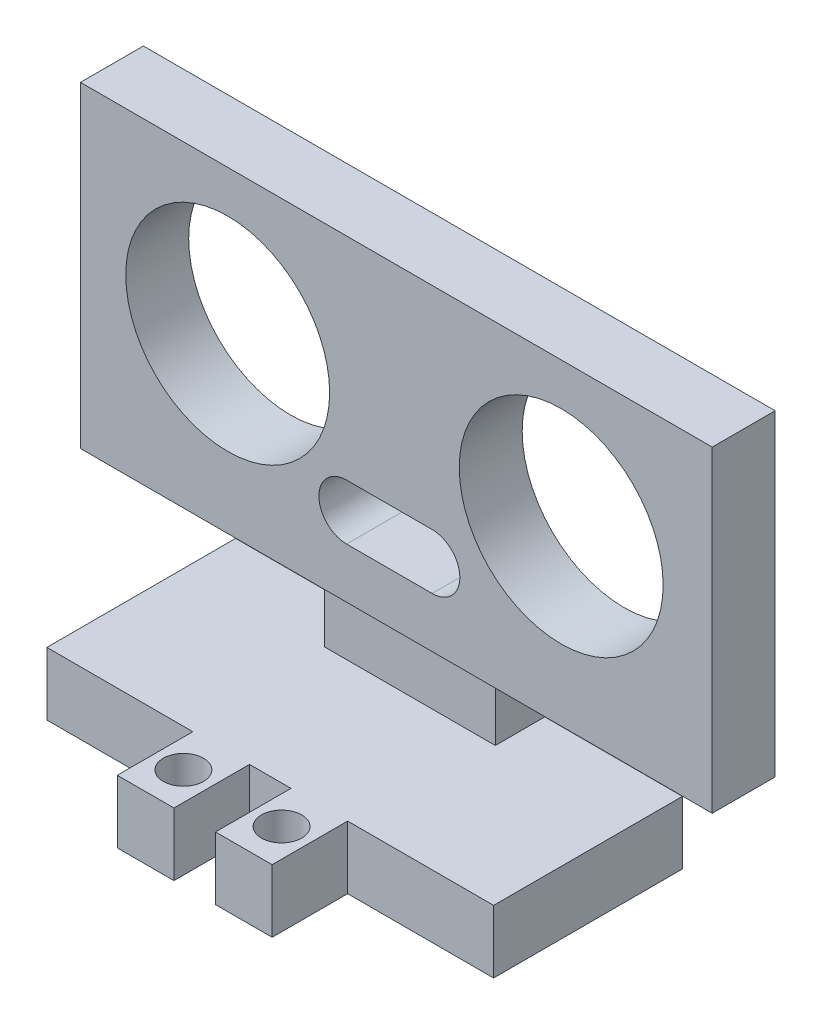
ISO-10303-21;
HEADER;
FILE_DESCRIPTION(('STEP AP214'),'2;1');
FILE_NAME('part.step','',(''),(''),'','','');
FILE_SCHEMA(('AUTOMOTIVE_DESIGN { 1 0 10303 214 1 1 1 1 }'));
ENDSEC;
DATA;
#1=APPLICATION_CONTEXT('core data for automotive mechanical design processes');
#2=APPLICATION_PROTOCOL_DEFINITION('international standard','automotive_design',2000,#1);
#3=PRODUCT_CONTEXT('',#1,'mechanical');
#4=PRODUCT('Part','Part','',(#3));
#5=PRODUCT_RELATED_PRODUCT_CATEGORY('part','',(#4));
#6=PRODUCT_DEFINITION_FORMATION('','',#4);
#7=PRODUCT_DEFINITION_CONTEXT('part definition',#1,'design');
#8=PRODUCT_DEFINITION('design','',#6,#7);
#9=PRODUCT_DEFINITION_SHAPE('','',#8);
#10=(LENGTH_UNIT() NAMED_UNIT(*) SI_UNIT(.MILLI.,.METRE.));
#11=(NAMED_UNIT(*) PLANE_ANGLE_UNIT() SI_UNIT($,.RADIAN.));
#12=(NAMED_UNIT(*) SI_UNIT($,.STERADIAN.) SOLID_ANGLE_UNIT());
#13=UNCERTAINTY_MEASURE_WITH_UNIT(LENGTH_MEASURE(1.E-05),#10,'distance_accuracy_value','');
#14=(GEOMETRIC_REPRESENTATION_CONTEXT(3) GLOBAL_UNCERTAINTY_ASSIGNED_CONTEXT((#13)) GLOBAL_UNIT_ASSIGNED_CONTEXT((#10,
#11,#12)) REPRESENTATION_CONTEXT('',''));
#15=CARTESIAN_POINT('',(0.,0.,0.));
#16=DIRECTION('',(0.,0.,1.));
#17=DIRECTION('',(1.,0.,0.));
#18=AXIS2_PLACEMENT_3D('',#15,#16,#17);
#19=CARTESIAN_POINT('',(0.,5.,-21.2753882568971));
#20=DIRECTION('',(0.,0.,-1.));
#21=DIRECTION('',(-1.,0.,0.));
#22=AXIS2_PLACEMENT_3D('',#19,#20,#21);
#23=PLANE('',#22);
#24=DIRECTION('',(1.,0.,0.));
#25=VECTOR('',#24,1.);
#26=CARTESIAN_POINT('',(0.,0.,-21.2753882568971));
#27=LINE('',#26,#25);
#28=CARTESIAN_POINT('',(12.7692142640546,0.,-21.2753882568971));
#29=VERTEX_POINT('',#28);
#30=CARTESIAN_POINT('',(48.2692142640546,0.,-21.2753882568971));
#31=VERTEX_POINT('',#30);
#32=EDGE_CURVE('E305',#29,#31,#27,.T.);
#33=ORIENTED_EDGE('',*,*,#32,.F.);
#34=DIRECTION('',(0.,-1.,0.));
#35=VECTOR('',#34,1.);
#36=CARTESIAN_POINT('',(12.7692142640546,5.,-21.2753882568971));
#37=LINE('',#36,#35);
#38=CARTESIAN_POINT('',(12.7692142640546,5.,-21.2753882568971));
#39=VERTEX_POINT('',#38);
#40=EDGE_CURVE('E392',#39,#29,#37,.T.);
#41=ORIENTED_EDGE('',*,*,#40,.F.);
#42=DIRECTION('',(1.,0.,0.));
#43=VECTOR('',#42,1.);
#44=CARTESIAN_POINT('',(0.,5.,-21.2753882568971));
#45=LINE('',#44,#43);
#46=CARTESIAN_POINT('',(23.7692142640546,5.,-21.2753882568971));
#47=VERTEX_POINT('',#46);
#48=EDGE_CURVE('E306',#39,#47,#45,.T.);
#49=ORIENTED_EDGE('',*,*,#48,.T.);
#50=DIRECTION('',(0.,-1.,0.));
#51=VECTOR('',#50,1.);
#52=CARTESIAN_POINT('',(23.7692142640546,10.,-21.2753882568971));
#53=LINE('',#52,#51);
#54=CARTESIAN_POINT('',(23.7692142640546,10.,-21.2753882568971));
#55=VERTEX_POINT('',#54);
#56=EDGE_CURVE('E286',#55,#47,#53,.T.);
#57=ORIENTED_EDGE('',*,*,#56,.F.);
#58=DIRECTION('',(-1.,0.,0.));
#59=VECTOR('',#58,1.);
#60=CARTESIAN_POINT('',(23.7692142640546,10.,-21.2753882568971));
#61=LINE('',#60,#59);
#62=CARTESIAN_POINT('',(37.3362993394962,10.,-21.2753882568971));
#63=VERTEX_POINT('',#62);
#64=EDGE_CURVE('E283',#63,#55,#61,.T.);
#65=ORIENTED_EDGE('',*,*,#64,.F.);
#66=DIRECTION('',(0.,-1.,0.));
#67=VECTOR('',#66,1.);
#68=CARTESIAN_POINT('',(37.3362993394962,10.,-21.2753882568971));
#69=LINE('',#68,#67);
#70=CARTESIAN_POINT('',(37.3362993394962,5.,-21.2753882568971));
#71=VERTEX_POINT('',#70);
#72=EDGE_CURVE('E296',#63,#71,#69,.T.);
#73=ORIENTED_EDGE('',*,*,#72,.T.);
#74=CARTESIAN_POINT('',(48.2692142640546,5.,-21.2753882568971));
#75=VERTEX_POINT('',#74);
#76=EDGE_CURVE('E310',#71,#75,#45,.T.);
#77=ORIENTED_EDGE('',*,*,#76,.T.);
#78=DIRECTION('',(0.,-1.,0.));
#79=VECTOR('',#78,1.);
#80=CARTESIAN_POINT('',(48.2692142640546,5.,-21.2753882568971));
#81=LINE('',#80,#79);
#82=EDGE_CURVE('E335',#75,#31,#81,.T.);
#83=ORIENTED_EDGE('',*,*,#82,.T.);
#84=EDGE_LOOP('',(#33,#41,#49,#57,#65,#73,#77,#83));
#85=FACE_BOUND('',#84,.T.);
#86=ADVANCED_FACE('F45',(#85),#23,.T.);
#87=CARTESIAN_POINT('',(12.7692142640546,5.,0.));
#88=DIRECTION('',(1.,0.,0.));
#89=DIRECTION('',(0.,0.,-1.));
#90=AXIS2_PLACEMENT_3D('',#87,#88,#89);
#91=PLANE('',#90);
#92=DIRECTION('',(0.,0.,1.));
#93=VECTOR('',#92,1.);
#94=CARTESIAN_POINT('',(12.7692142640546,0.,0.));
#95=LINE('',#94,#93);
#96=CARTESIAN_POINT('',(12.7692142640546,0.,-6.27538825689709));
#97=VERTEX_POINT('',#96);
#98=EDGE_CURVE('E338',#29,#97,#95,.T.);
#99=ORIENTED_EDGE('',*,*,#98,.T.);
#100=DIRECTION('',(0.,-1.,0.));
#101=VECTOR('',#100,1.);
#102=CARTESIAN_POINT('',(12.7692142640546,5.,-6.27538825689709));
#103=LINE('',#102,#101);
#104=CARTESIAN_POINT('',(12.7692142640546,5.,-6.27538825689709));
#105=VERTEX_POINT('',#104);
#106=EDGE_CURVE('E389',#105,#97,#103,.T.);
#107=ORIENTED_EDGE('',*,*,#106,.F.);
#108=DIRECTION('',(0.,0.,1.));
#109=VECTOR('',#108,1.);
#110=CARTESIAN_POINT('',(12.7692142640546,5.,0.));
#111=LINE('',#110,#109);
#112=EDGE_CURVE('E309',#39,#105,#111,.T.);
#113=ORIENTED_EDGE('',*,*,#112,.F.);
#114=ORIENTED_EDGE('',*,*,#40,.T.);
#115=EDGE_LOOP('',(#99,#107,#113,#114));
#116=FACE_BOUND('',#115,.T.);
#117=ADVANCED_FACE('F454',(#116),#91,.F.);
#118=CARTESIAN_POINT('',(0.,5.,-6.27538825689709));
#119=DIRECTION('',(0.,0.,-1.));
#120=DIRECTION('',(-1.,0.,0.));
#121=AXIS2_PLACEMENT_3D('',#118,#119,#120);
#122=PLANE('',#121);
#123=DIRECTION('',(1.,0.,0.));
#124=VECTOR('',#123,1.);
#125=CARTESIAN_POINT('',(0.,0.,-6.27538825689709));
#126=LINE('',#125,#124);
#127=CARTESIAN_POINT('',(24.3692142640547,0.,-6.27538825689709));
#128=VERTEX_POINT('',#127);
#129=EDGE_CURVE('E340',#97,#128,#126,.T.);
#130=ORIENTED_EDGE('',*,*,#129,.T.);
#131=DIRECTION('',(0.,-1.,0.));
#132=VECTOR('',#131,1.);
#133=CARTESIAN_POINT('',(24.3692142640547,5.,-6.27538825689709));
#134=LINE('',#133,#132);
#135=CARTESIAN_POINT('',(24.3692142640547,5.,-6.27538825689709));
#136=VERTEX_POINT('',#135);
#137=EDGE_CURVE('E387',#136,#128,#134,.T.);
#138=ORIENTED_EDGE('',*,*,#137,.F.);
#139=DIRECTION('',(1.,0.,0.));
#140=VECTOR('',#139,1.);
#141=CARTESIAN_POINT('',(0.,5.,-6.27538825689709));
#142=LINE('',#141,#140);
#143=EDGE_CURVE('E312',#105,#136,#142,.T.);
#144=ORIENTED_EDGE('',*,*,#143,.F.);
#145=ORIENTED_EDGE('',*,*,#106,.T.);
#146=EDGE_LOOP('',(#130,#138,#144,#145));
#147=FACE_BOUND('',#146,.T.);
#148=ADVANCED_FACE('F459',(#147),#122,.F.);
#149=CARTESIAN_POINT('',(24.3692142640547,5.,0.));
#150=DIRECTION('',(-1.,0.,0.));
#151=DIRECTION('',(0.,0.,1.));
#152=AXIS2_PLACEMENT_3D('',#149,#150,#151);
#153=PLANE('',#152);
#154=DIRECTION('',(0.,0.,-1.));
#155=VECTOR('',#154,1.);
#156=CARTESIAN_POINT('',(24.3692142640547,0.,0.));
#157=LINE('',#156,#155);
#158=CARTESIAN_POINT('',(24.3692142640547,0.,-0.275388256897094));
#159=VERTEX_POINT('',#158);
#160=EDGE_CURVE('E343',#159,#128,#157,.T.);
#161=ORIENTED_EDGE('',*,*,#160,.F.);
#162=DIRECTION('',(0.,-1.,0.));
#163=VECTOR('',#162,1.);
#164=CARTESIAN_POINT('',(24.3692142640547,5.,-0.275388256897094));
#165=LINE('',#164,#163);
#166=CARTESIAN_POINT('',(24.3692142640547,5.,-0.275388256897094));
#167=VERTEX_POINT('',#166);
#168=EDGE_CURVE('E385',#167,#159,#165,.T.);
#169=ORIENTED_EDGE('',*,*,#168,.F.);
#170=DIRECTION('',(0.,0.,-1.));
#171=VECTOR('',#170,1.);
#172=CARTESIAN_POINT('',(24.3692142640547,5.,0.));
#173=LINE('',#172,#171);
#174=EDGE_CURVE('E314',#167,#136,#173,.T.);
#175=ORIENTED_EDGE('',*,*,#174,.T.);
#176=ORIENTED_EDGE('',*,*,#137,.T.);
#177=EDGE_LOOP('',(#161,#169,#175,#176));
#178=FACE_BOUND('',#177,.T.);
#179=ADVANCED_FACE('F464',(#178),#153,.T.);
#180=CARTESIAN_POINT('',(0.,5.,-0.275388256897092));
#181=DIRECTION('',(0.,0.,-1.));
#182=DIRECTION('',(-1.,0.,0.));
#183=AXIS2_PLACEMENT_3D('',#180,#181,#182);
#184=PLANE('',#183);
#185=DIRECTION('',(1.,0.,0.));
#186=VECTOR('',#185,1.);
#187=CARTESIAN_POINT('',(0.,0.,-0.275388256897092));
#188=LINE('',#187,#186);
#189=CARTESIAN_POINT('',(28.8692142640547,0.,-0.275388256897094));
#190=VERTEX_POINT('',#189);
#191=EDGE_CURVE('E346',#159,#190,#188,.T.);
#192=ORIENTED_EDGE('',*,*,#191,.T.);
#193=DIRECTION('',(0.,-1.,0.));
#194=VECTOR('',#193,1.);
#195=CARTESIAN_POINT('',(28.8692142640547,5.,-0.275388256897094));
#196=LINE('',#195,#194);
#197=CARTESIAN_POINT('',(28.8692142640547,5.,-0.275388256897094));
#198=VERTEX_POINT('',#197);
#199=EDGE_CURVE('E382',#198,#190,#196,.T.);
#200=ORIENTED_EDGE('',*,*,#199,.F.);
#201=DIRECTION('',(1.,0.,0.));
#202=VECTOR('',#201,1.);
#203=CARTESIAN_POINT('',(0.,5.,-0.275388256897092));
#204=LINE('',#203,#202);
#205=EDGE_CURVE('E317',#167,#198,#204,.T.);
#206=ORIENTED_EDGE('',*,*,#205,.F.);
#207=ORIENTED_EDGE('',*,*,#168,.T.);
#208=EDGE_LOOP('',(#192,#200,#206,#207));
#209=FACE_BOUND('',#208,.T.);
#210=ADVANCED_FACE('F470',(#209),#184,.F.);
#211=CARTESIAN_POINT('',(28.8692142640547,5.,0.));
#212=DIRECTION('',(-1.,0.,0.));
#213=DIRECTION('',(0.,0.,1.));
#214=AXIS2_PLACEMENT_3D('',#211,#212,#213);
#215=PLANE('',#214);
#216=DIRECTION('',(0.,0.,-1.));
#217=VECTOR('',#216,1.);
#218=CARTESIAN_POINT('',(28.8692142640547,0.,0.));
#219=LINE('',#218,#217);
#220=CARTESIAN_POINT('',(28.8692142640547,0.,-6.27538825689709));
#221=VERTEX_POINT('',#220);
#222=EDGE_CURVE('E348',#190,#221,#219,.T.);
#223=ORIENTED_EDGE('',*,*,#222,.T.);
#224=DIRECTION('',(0.,-1.,0.));
#225=VECTOR('',#224,1.);
#226=CARTESIAN_POINT('',(28.8692142640547,5.,-6.27538825689709));
#227=LINE('',#226,#225);
#228=CARTESIAN_POINT('',(28.8692142640547,5.,-6.27538825689709));
#229=VERTEX_POINT('',#228);
#230=EDGE_CURVE('E379',#229,#221,#227,.T.);
#231=ORIENTED_EDGE('',*,*,#230,.F.);
#232=DIRECTION('',(0.,0.,-1.));
#233=VECTOR('',#232,1.);
#234=CARTESIAN_POINT('',(28.8692142640547,5.,0.));
#235=LINE('',#234,#233);
#236=EDGE_CURVE('E319',#198,#229,#235,.T.);
#237=ORIENTED_EDGE('',*,*,#236,.F.);
#238=ORIENTED_EDGE('',*,*,#199,.T.);
#239=EDGE_LOOP('',(#223,#231,#237,#238));
#240=FACE_BOUND('',#239,.T.);
#241=ADVANCED_FACE('F474',(#240),#215,.F.);
#242=CARTESIAN_POINT('',(0.,5.,-6.27538825689709));
#243=DIRECTION('',(0.,0.,-1.));
#244=DIRECTION('',(-1.,0.,0.));
#245=AXIS2_PLACEMENT_3D('',#242,#243,#244);
#246=PLANE('',#245);
#247=DIRECTION('',(1.,0.,0.));
#248=VECTOR('',#247,1.);
#249=CARTESIAN_POINT('',(0.,0.,-6.27538825689709));
#250=LINE('',#249,#248);
#251=CARTESIAN_POINT('',(32.1692142640546,0.,-6.27538825689709));
#252=VERTEX_POINT('',#251);
#253=EDGE_CURVE('E350',#221,#252,#250,.T.);
#254=ORIENTED_EDGE('',*,*,#253,.T.);
#255=DIRECTION('',(0.,-1.,0.));
#256=VECTOR('',#255,1.);
#257=CARTESIAN_POINT('',(32.1692142640546,5.,-6.27538825689709));
#258=LINE('',#257,#256);
#259=CARTESIAN_POINT('',(32.1692142640546,5.,-6.27538825689709));
#260=VERTEX_POINT('',#259);
#261=EDGE_CURVE('E377',#260,#252,#258,.T.);
#262=ORIENTED_EDGE('',*,*,#261,.F.);
#263=DIRECTION('',(1.,0.,0.));
#264=VECTOR('',#263,1.);
#265=CARTESIAN_POINT('',(0.,5.,-6.27538825689709));
#266=LINE('',#265,#264);
#267=EDGE_CURVE('E321',#229,#260,#266,.T.);
#268=ORIENTED_EDGE('',*,*,#267,.F.);
#269=ORIENTED_EDGE('',*,*,#230,.T.);
#270=EDGE_LOOP('',(#254,#262,#268,#269));
#271=FACE_BOUND('',#270,.T.);
#272=ADVANCED_FACE('F478',(#271),#246,.F.);
#273=CARTESIAN_POINT('',(32.1692142640546,5.,0.));
#274=DIRECTION('',(-1.,0.,0.));
#275=DIRECTION('',(0.,0.,1.));
#276=AXIS2_PLACEMENT_3D('',#273,#274,#275);
#277=PLANE('',#276);
#278=DIRECTION('',(0.,0.,-1.));
#279=VECTOR('',#278,1.);
#280=CARTESIAN_POINT('',(32.1692142640546,0.,0.));
#281=LINE('',#280,#279);
#282=CARTESIAN_POINT('',(32.1692142640546,0.,-0.275388256897094));
#283=VERTEX_POINT('',#282);
#284=EDGE_CURVE('E353',#283,#252,#281,.T.);
#285=ORIENTED_EDGE('',*,*,#284,.F.);
#286=DIRECTION('',(0.,-1.,0.));
#287=VECTOR('',#286,1.);
#288=CARTESIAN_POINT('',(32.1692142640546,5.,-0.275388256897094));
#289=LINE('',#288,#287);
#290=CARTESIAN_POINT('',(32.1692142640546,5.,-0.275388256897094));
#291=VERTEX_POINT('',#290);
#292=EDGE_CURVE('E375',#291,#283,#289,.T.);
#293=ORIENTED_EDGE('',*,*,#292,.F.);
#294=DIRECTION('',(0.,0.,-1.));
#295=VECTOR('',#294,1.);
#296=CARTESIAN_POINT('',(32.1692142640546,5.,0.));
#297=LINE('',#296,#295);
#298=EDGE_CURVE('E323',#291,#260,#297,.T.);
#299=ORIENTED_EDGE('',*,*,#298,.T.);
#300=ORIENTED_EDGE('',*,*,#261,.T.);
#301=EDGE_LOOP('',(#285,#293,#299,#300));
#302=FACE_BOUND('',#301,.T.);
#303=ADVANCED_FACE('F482',(#302),#277,.T.);
#304=CARTESIAN_POINT('',(0.,5.,-0.275388256897095));
#305=DIRECTION('',(0.,0.,-1.));
#306=DIRECTION('',(-1.,0.,0.));
#307=AXIS2_PLACEMENT_3D('',#304,#305,#306);
#308=PLANE('',#307);
#309=DIRECTION('',(1.,0.,0.));
#310=VECTOR('',#309,1.);
#311=CARTESIAN_POINT('',(0.,0.,-0.275388256897095));
#312=LINE('',#311,#310);
#313=CARTESIAN_POINT('',(36.6692142640546,0.,-0.275388256897094));
#314=VERTEX_POINT('',#313);
#315=EDGE_CURVE('E356',#283,#314,#312,.T.);
#316=ORIENTED_EDGE('',*,*,#315,.T.);
#317=DIRECTION('',(0.,-1.,0.));
#318=VECTOR('',#317,1.);
#319=CARTESIAN_POINT('',(36.6692142640546,5.,-0.275388256897094));
#320=LINE('',#319,#318);
#321=CARTESIAN_POINT('',(36.6692142640546,5.,-0.275388256897094));
#322=VERTEX_POINT('',#321);
#323=EDGE_CURVE('E372',#322,#314,#320,.T.);
#324=ORIENTED_EDGE('',*,*,#323,.F.);
#325=DIRECTION('',(1.,0.,0.));
#326=VECTOR('',#325,1.);
#327=CARTESIAN_POINT('',(0.,5.,-0.275388256897095));
#328=LINE('',#327,#326);
#329=EDGE_CURVE('E326',#291,#322,#328,.T.);
#330=ORIENTED_EDGE('',*,*,#329,.F.);
#331=ORIENTED_EDGE('',*,*,#292,.T.);
#332=EDGE_LOOP('',(#316,#324,#330,#331));
#333=FACE_BOUND('',#332,.T.);
#334=ADVANCED_FACE('F486',(#333),#308,.F.);
#335=CARTESIAN_POINT('',(36.6692142640546,5.,0.));
#336=DIRECTION('',(-1.,0.,0.));
#337=DIRECTION('',(0.,0.,1.));
#338=AXIS2_PLACEMENT_3D('',#335,#336,#337);
#339=PLANE('',#338);
#340=DIRECTION('',(0.,0.,-1.));
#341=VECTOR('',#340,1.);
#342=CARTESIAN_POINT('',(36.6692142640546,0.,0.));
#343=LINE('',#342,#341);
#344=CARTESIAN_POINT('',(36.6692142640546,0.,-6.27538825689709));
#345=VERTEX_POINT('',#344);
#346=EDGE_CURVE('E358',#314,#345,#343,.T.);
#347=ORIENTED_EDGE('',*,*,#346,.T.);
#348=DIRECTION('',(0.,-1.,0.));
#349=VECTOR('',#348,1.);
#350=CARTESIAN_POINT('',(36.6692142640546,5.,-6.27538825689709));
#351=LINE('',#350,#349);
#352=CARTESIAN_POINT('',(36.6692142640546,5.,-6.27538825689709));
#353=VERTEX_POINT('',#352);
#354=EDGE_CURVE('E369',#353,#345,#351,.T.);
#355=ORIENTED_EDGE('',*,*,#354,.F.);
#356=DIRECTION('',(0.,0.,-1.));
#357=VECTOR('',#356,1.);
#358=CARTESIAN_POINT('',(36.6692142640546,5.,0.));
#359=LINE('',#358,#357);
#360=EDGE_CURVE('E328',#322,#353,#359,.T.);
#361=ORIENTED_EDGE('',*,*,#360,.F.);
#362=ORIENTED_EDGE('',*,*,#323,.T.);
#363=EDGE_LOOP('',(#347,#355,#361,#362));
#364=FACE_BOUND('',#363,.T.);
#365=ADVANCED_FACE('F490',(#364),#339,.F.);
#366=CARTESIAN_POINT('',(0.,5.,-6.27538825689709));
#367=DIRECTION('',(0.,0.,-1.));
#368=DIRECTION('',(-1.,0.,0.));
#369=AXIS2_PLACEMENT_3D('',#366,#367,#368);
#370=PLANE('',#369);
#371=DIRECTION('',(1.,0.,0.));
#372=VECTOR('',#371,1.);
#373=CARTESIAN_POINT('',(0.,0.,-6.27538825689709));
#374=LINE('',#373,#372);
#375=CARTESIAN_POINT('',(48.2692142640546,0.,-6.27538825689709));
#376=VERTEX_POINT('',#375);
#377=EDGE_CURVE('E360',#345,#376,#374,.T.);
#378=ORIENTED_EDGE('',*,*,#377,.T.);
#379=DIRECTION('',(0.,-1.,0.));
#380=VECTOR('',#379,1.);
#381=CARTESIAN_POINT('',(48.2692142640546,5.,-6.27538825689709));
#382=LINE('',#381,#380);
#383=CARTESIAN_POINT('',(48.2692142640546,5.,-6.27538825689709));
#384=VERTEX_POINT('',#383);
#385=EDGE_CURVE('E367',#384,#376,#382,.T.);
#386=ORIENTED_EDGE('',*,*,#385,.F.);
#387=DIRECTION('',(1.,0.,0.));
#388=VECTOR('',#387,1.);
#389=CARTESIAN_POINT('',(0.,5.,-6.27538825689709));
#390=LINE('',#389,#388);
#391=EDGE_CURVE('E330',#353,#384,#390,.T.);
#392=ORIENTED_EDGE('',*,*,#391,.F.);
#393=ORIENTED_EDGE('',*,*,#354,.T.);
#394=EDGE_LOOP('',(#378,#386,#392,#393));
#395=FACE_BOUND('',#394,.T.);
#396=ADVANCED_FACE('F494',(#395),#370,.F.);
#397=CARTESIAN_POINT('',(48.2692142640546,5.,0.));
#398=DIRECTION('',(1.,0.,0.));
#399=DIRECTION('',(0.,0.,-1.));
#400=AXIS2_PLACEMENT_3D('',#397,#398,#399);
#401=PLANE('',#400);
#402=DIRECTION('',(0.,0.,1.));
#403=VECTOR('',#402,1.);
#404=CARTESIAN_POINT('',(48.2692142640546,0.,0.));
#405=LINE('',#404,#403);
#406=EDGE_CURVE('E363',#31,#376,#405,.T.);
#407=ORIENTED_EDGE('',*,*,#406,.F.);
#408=ORIENTED_EDGE('',*,*,#82,.F.);
#409=DIRECTION('',(0.,0.,1.));
#410=VECTOR('',#409,1.);
#411=CARTESIAN_POINT('',(48.2692142640546,5.,0.));
#412=LINE('',#411,#410);
#413=EDGE_CURVE('E332',#75,#384,#412,.T.);
#414=ORIENTED_EDGE('',*,*,#413,.T.);
#415=ORIENTED_EDGE('',*,*,#385,.T.);
#416=EDGE_LOOP('',(#407,#408,#414,#415));
#417=FACE_BOUND('',#416,.T.);
#418=ADVANCED_FACE('F423',(#417),#401,.T.);
#419=CARTESIAN_POINT('',(0.,5.,0.));
#420=DIRECTION('',(0.,1.,0.));
#421=DIRECTION('',(0.,0.,1.));
#422=AXIS2_PLACEMENT_3D('',#419,#420,#421);
#423=PLANE('',#422);
#424=CARTESIAN_POINT('',(26.6192142640546,5.,-3.27538825689709));
#425=DIRECTION('',(0.,1.,0.));
#426=DIRECTION('',(0.,0.,1.));
#427=AXIS2_PLACEMENT_3D('',#424,#425,#426);
#428=CIRCLE('',#427,1.6);
#429=CARTESIAN_POINT('',(26.6192142640546,5.,-1.67538825689709));
#430=VERTEX_POINT('',#429);
#431=EDGE_CURVE('E403',#430,#430,#428,.T.);
#432=ORIENTED_EDGE('',*,*,#431,.F.);
#433=EDGE_LOOP('',(#432));
#434=FACE_BOUND('',#433,.T.);
#435=CARTESIAN_POINT('',(34.4192142640546,5.,-3.27538825689709));
#436=DIRECTION('',(0.,1.,0.));
#437=DIRECTION('',(0.,0.,1.));
#438=AXIS2_PLACEMENT_3D('',#435,#436,#437);
#439=CIRCLE('',#438,1.6);
#440=CARTESIAN_POINT('',(34.4192142640546,5.,-1.6753882568971));
#441=VERTEX_POINT('',#440);
#442=EDGE_CURVE('E408',#441,#441,#439,.T.);
#443=ORIENTED_EDGE('',*,*,#442,.F.);
#444=EDGE_LOOP('',(#443));
#445=FACE_BOUND('',#444,.T.);
#446=DIRECTION('',(0.,0.,1.));
#447=VECTOR('',#446,1.);
#448=CARTESIAN_POINT('',(23.7692142640546,5.,-21.2753882568971));
#449=LINE('',#448,#447);
#450=CARTESIAN_POINT('',(23.7692142640546,5.,-17.3425959706985));
#451=VERTEX_POINT('',#450);
#452=EDGE_CURVE('E272',#47,#451,#449,.T.);
#453=ORIENTED_EDGE('',*,*,#452,.F.);
#454=ORIENTED_EDGE('',*,*,#48,.F.);
#455=ORIENTED_EDGE('',*,*,#112,.T.);
#456=ORIENTED_EDGE('',*,*,#143,.T.);
#457=ORIENTED_EDGE('',*,*,#174,.F.);
#458=ORIENTED_EDGE('',*,*,#205,.T.);
#459=ORIENTED_EDGE('',*,*,#236,.T.);
#460=ORIENTED_EDGE('',*,*,#267,.T.);
#461=ORIENTED_EDGE('',*,*,#298,.F.);
#462=ORIENTED_EDGE('',*,*,#329,.T.);
#463=ORIENTED_EDGE('',*,*,#360,.T.);
#464=ORIENTED_EDGE('',*,*,#391,.T.);
#465=ORIENTED_EDGE('',*,*,#413,.F.);
#466=ORIENTED_EDGE('',*,*,#76,.F.);
#467=DIRECTION('',(0.,0.,-1.));
#468=VECTOR('',#467,1.);
#469=CARTESIAN_POINT('',(37.3362993394962,5.,-21.2753882568971));
#470=LINE('',#469,#468);
#471=CARTESIAN_POINT('',(37.3362993394962,5.,-17.3425959706985));
#472=VERTEX_POINT('',#471);
#473=EDGE_CURVE('E277',#472,#71,#470,.T.);
#474=ORIENTED_EDGE('',*,*,#473,.F.);
#475=DIRECTION('',(1.,0.,0.));
#476=VECTOR('',#475,1.);
#477=CARTESIAN_POINT('',(23.7692142640546,5.,-17.3425959706985));
#478=LINE('',#477,#476);
#479=EDGE_CURVE('E289',#451,#472,#478,.T.);
#480=ORIENTED_EDGE('',*,*,#479,.F.);
#481=EDGE_LOOP('',(#453,#454,#455,#456,#457,#458,#459,#460,#461,#462,#463,#464,#465,#466,#474,#480));
#482=FACE_BOUND('',#481,.T.);
#483=ADVANCED_FACE('F419',(#434,#445,#482),#423,.T.);
#484=CARTESIAN_POINT('',(0.,0.,0.));
#485=DIRECTION('',(0.,1.,0.));
#486=DIRECTION('',(0.,0.,1.));
#487=AXIS2_PLACEMENT_3D('',#484,#485,#486);
#488=PLANE('',#487);
#489=CARTESIAN_POINT('',(26.6192142640546,0.,-3.27538825689709));
#490=DIRECTION('',(0.,1.,0.));
#491=DIRECTION('',(0.,0.,1.));
#492=AXIS2_PLACEMENT_3D('',#489,#490,#491);
#493=CIRCLE('',#492,1.6);
#494=CARTESIAN_POINT('',(26.6192142640546,0.,-1.67538825689709));
#495=VERTEX_POINT('',#494);
#496=EDGE_CURVE('E48',#495,#495,#493,.T.);
#497=ORIENTED_EDGE('',*,*,#496,.T.);
#498=EDGE_LOOP('',(#497));
#499=FACE_BOUND('',#498,.T.);
#500=CARTESIAN_POINT('',(34.4192142640546,0.,-3.27538825689709));
#501=DIRECTION('',(0.,1.,0.));
#502=DIRECTION('',(0.,0.,1.));
#503=AXIS2_PLACEMENT_3D('',#500,#501,#502);
#504=CIRCLE('',#503,1.6);
#505=CARTESIAN_POINT('',(34.4192142640546,0.,-1.6753882568971));
#506=VERTEX_POINT('',#505);
#507=EDGE_CURVE('E401',#506,#506,#504,.T.);
#508=ORIENTED_EDGE('',*,*,#507,.T.);
#509=EDGE_LOOP('',(#508));
#510=FACE_BOUND('',#509,.T.);
#511=ORIENTED_EDGE('',*,*,#32,.T.);
#512=ORIENTED_EDGE('',*,*,#406,.T.);
#513=ORIENTED_EDGE('',*,*,#377,.F.);
#514=ORIENTED_EDGE('',*,*,#346,.F.);
#515=ORIENTED_EDGE('',*,*,#315,.F.);
#516=ORIENTED_EDGE('',*,*,#284,.T.);
#517=ORIENTED_EDGE('',*,*,#253,.F.);
#518=ORIENTED_EDGE('',*,*,#222,.F.);
#519=ORIENTED_EDGE('',*,*,#191,.F.);
#520=ORIENTED_EDGE('',*,*,#160,.T.);
#521=ORIENTED_EDGE('',*,*,#129,.F.);
#522=ORIENTED_EDGE('',*,*,#98,.F.);
#523=EDGE_LOOP('',(#511,#512,#513,#514,#515,#516,#517,#518,#519,#520,#521,#522));
#524=FACE_BOUND('',#523,.T.);
#525=ADVANCED_FACE('F422',(#499,#510,#524),#488,.F.);
#526=CARTESIAN_POINT('',(23.7692142640546,10.,-21.2753882568971));
#527=DIRECTION('',(1.,0.,0.));
#528=DIRECTION('',(0.,0.,-1.));
#529=AXIS2_PLACEMENT_3D('',#526,#527,#528);
#530=PLANE('',#529);
#531=ORIENTED_EDGE('',*,*,#452,.T.);
#532=DIRECTION('',(0.,-1.,0.));
#533=VECTOR('',#532,1.);
#534=CARTESIAN_POINT('',(23.7692142640546,10.,-17.3425959706985));
#535=LINE('',#534,#533);
#536=CARTESIAN_POINT('',(23.7692142640546,10.,-17.3425959706985));
#537=VERTEX_POINT('',#536);
#538=EDGE_CURVE('E302',#537,#451,#535,.T.);
#539=ORIENTED_EDGE('',*,*,#538,.F.);
#540=DIRECTION('',(0.,0.,1.));
#541=VECTOR('',#540,1.);
#542=CARTESIAN_POINT('',(23.7692142640546,10.,-21.2753882568971));
#543=LINE('',#542,#541);
#544=EDGE_CURVE('E273',#55,#537,#543,.T.);
#545=ORIENTED_EDGE('',*,*,#544,.F.);
#546=ORIENTED_EDGE('',*,*,#56,.T.);
#547=EDGE_LOOP('',(#531,#539,#545,#546));
#548=FACE_BOUND('',#547,.T.);
#549=ADVANCED_FACE('F434',(#548),#530,.F.);
#550=CARTESIAN_POINT('',(23.7692142640546,10.,-17.3425959706985));
#551=DIRECTION('',(0.,0.,-1.));
#552=DIRECTION('',(-1.,0.,0.));
#553=AXIS2_PLACEMENT_3D('',#550,#551,#552);
#554=PLANE('',#553);
#555=ORIENTED_EDGE('',*,*,#479,.T.);
#556=DIRECTION('',(0.,-1.,0.));
#557=VECTOR('',#556,1.);
#558=CARTESIAN_POINT('',(37.3362993394962,10.,-17.3425959706985));
#559=LINE('',#558,#557);
#560=CARTESIAN_POINT('',(37.3362993394962,10.,-17.3425959706985));
#561=VERTEX_POINT('',#560);
#562=EDGE_CURVE('E299',#561,#472,#559,.T.);
#563=ORIENTED_EDGE('',*,*,#562,.F.);
#564=DIRECTION('',(1.,0.,0.));
#565=VECTOR('',#564,1.);
#566=CARTESIAN_POINT('',(23.7692142640546,10.,-17.3425959706985));
#567=LINE('',#566,#565);
#568=EDGE_CURVE('E276',#537,#561,#567,.T.);
#569=ORIENTED_EDGE('',*,*,#568,.F.);
#570=ORIENTED_EDGE('',*,*,#538,.T.);
#571=EDGE_LOOP('',(#555,#563,#569,#570));
#572=FACE_BOUND('',#571,.T.);
#573=ADVANCED_FACE('F444',(#572),#554,.F.);
#574=CARTESIAN_POINT('',(37.3362993394962,10.,-21.2753882568971));
#575=DIRECTION('',(-1.,0.,0.));
#576=DIRECTION('',(0.,0.,1.));
#577=AXIS2_PLACEMENT_3D('',#574,#575,#576);
#578=PLANE('',#577);
#579=ORIENTED_EDGE('',*,*,#473,.T.);
#580=ORIENTED_EDGE('',*,*,#72,.F.);
#581=DIRECTION('',(0.,0.,-1.));
#582=VECTOR('',#581,1.);
#583=CARTESIAN_POINT('',(37.3362993394962,10.,-21.2753882568971));
#584=LINE('',#583,#582);
#585=EDGE_CURVE('E280',#561,#63,#584,.T.);
#586=ORIENTED_EDGE('',*,*,#585,.F.);
#587=ORIENTED_EDGE('',*,*,#562,.T.);
#588=EDGE_LOOP('',(#579,#580,#586,#587));
#589=FACE_BOUND('',#588,.T.);
#590=ADVANCED_FACE('F441',(#589),#578,.F.);
#591=CARTESIAN_POINT('',(5.41921426405465,35.2,-16.2947715854473));
#592=DIRECTION('',(0.,0.,-1.));
#593=DIRECTION('',(-1.,0.,0.));
#594=AXIS2_PLACEMENT_3D('',#591,#592,#593);
#595=PLANE('',#594);
#596=CARTESIAN_POINT('',(33.3664211853097,16.2,-16.2947715854473));
#597=DIRECTION('',(0.,0.,1.));
#598=DIRECTION('',(1.,0.,0.));
#599=AXIS2_PLACEMENT_3D('',#596,#597,#598);
#600=CIRCLE('',#599,2.2);
#601=CARTESIAN_POINT('',(33.3664211853097,14.,-16.2947715854473));
#602=VERTEX_POINT('',#601);
#603=CARTESIAN_POINT('',(33.3664211853097,18.4,-16.2947715854473));
#604=VERTEX_POINT('',#603);
#605=EDGE_CURVE('E218',#602,#604,#600,.T.);
#606=ORIENTED_EDGE('',*,*,#605,.F.);
#607=DIRECTION('',(1.,0.,0.));
#608=VECTOR('',#607,1.);
#609=CARTESIAN_POINT('',(0.,14.,-16.2947715854473));
#610=LINE('',#609,#608);
#611=CARTESIAN_POINT('',(26.5664211853097,14.,-16.2947715854473));
#612=VERTEX_POINT('',#611);
#613=EDGE_CURVE('E61',#612,#602,#610,.T.);
#614=ORIENTED_EDGE('',*,*,#613,.F.);
#615=CARTESIAN_POINT('',(26.5664211853097,16.2,-16.2947715854473));
#616=DIRECTION('',(0.,0.,1.));
#617=DIRECTION('',(1.,0.,0.));
#618=AXIS2_PLACEMENT_3D('',#615,#616,#617);
#619=CIRCLE('',#618,2.2);
#620=CARTESIAN_POINT('',(26.5664211853097,18.4,-16.2947715854473));
#621=VERTEX_POINT('',#620);
#622=EDGE_CURVE('E225',#621,#612,#619,.T.);
#623=ORIENTED_EDGE('',*,*,#622,.F.);
#624=DIRECTION('',(1.,0.,0.));
#625=VECTOR('',#624,1.);
#626=CARTESIAN_POINT('',(0.,18.4,-16.2947715854473));
#627=LINE('',#626,#625);
#628=EDGE_CURVE('E209',#621,#604,#627,.T.);
#629=ORIENTED_EDGE('',*,*,#628,.T.);
#630=EDGE_LOOP('',(#606,#614,#623,#629));
#631=FACE_BOUND('',#630,.T.);
#632=CARTESIAN_POINT('',(17.1192142640547,23.75,-16.2947715854473));
#633=DIRECTION('',(0.,0.,1.));
#634=DIRECTION('',(1.,0.,0.));
#635=AXIS2_PLACEMENT_3D('',#632,#633,#634);
#636=CIRCLE('',#635,8.09999999999999);
#637=CARTESIAN_POINT('',(25.2192142640546,23.75,-16.2947715854473));
#638=VERTEX_POINT('',#637);
#639=EDGE_CURVE('E235',#638,#638,#636,.T.);
#640=ORIENTED_EDGE('',*,*,#639,.F.);
#641=EDGE_LOOP('',(#640));
#642=FACE_BOUND('',#641,.T.);
#643=CARTESIAN_POINT('',(43.6192142640547,23.75,-16.2947715854473));
#644=DIRECTION('',(0.,0.,1.));
#645=DIRECTION('',(1.,0.,0.));
#646=AXIS2_PLACEMENT_3D('',#643,#644,#645);
#647=CIRCLE('',#646,8.1);
#648=CARTESIAN_POINT('',(51.7192142640546,23.75,-16.2947715854473));
#649=VERTEX_POINT('',#648);
#650=EDGE_CURVE('E232',#649,#649,#647,.T.);
#651=ORIENTED_EDGE('',*,*,#650,.F.);
#652=EDGE_LOOP('',(#651));
#653=FACE_BOUND('',#652,.T.);
#654=DIRECTION('',(1.,0.,0.));
#655=VECTOR('',#654,1.);
#656=CARTESIAN_POINT('',(5.41921426405465,10.,-16.2947715854473));
#657=LINE('',#656,#655);
#658=CARTESIAN_POINT('',(5.41921426405465,10.,-16.2947715854473));
#659=VERTEX_POINT('',#658);
#660=CARTESIAN_POINT('',(55.6192142640547,10.,-16.2947715854473));
#661=VERTEX_POINT('',#660);
#662=EDGE_CURVE('E253',#659,#661,#657,.T.);
#663=ORIENTED_EDGE('',*,*,#662,.T.);
#664=DIRECTION('',(0.,-1.,0.));
#665=VECTOR('',#664,1.);
#666=CARTESIAN_POINT('',(55.6192142640547,35.2,-16.2947715854473));
#667=LINE('',#666,#665);
#668=CARTESIAN_POINT('',(55.6192142640547,35.2,-16.2947715854473));
#669=VERTEX_POINT('',#668);
#670=EDGE_CURVE('E270',#669,#661,#667,.T.);
#671=ORIENTED_EDGE('',*,*,#670,.F.);
#672=DIRECTION('',(1.,0.,0.));
#673=VECTOR('',#672,1.);
#674=CARTESIAN_POINT('',(5.41921426405465,35.2,-16.2947715854473));
#675=LINE('',#674,#673);
#676=CARTESIAN_POINT('',(5.41921426405465,35.2,-16.2947715854473));
#677=VERTEX_POINT('',#676);
#678=EDGE_CURVE('E241',#677,#669,#675,.T.);
#679=ORIENTED_EDGE('',*,*,#678,.F.);
#680=DIRECTION('',(0.,-1.,0.));
#681=VECTOR('',#680,1.);
#682=CARTESIAN_POINT('',(5.41921426405465,35.2,-16.2947715854473));
#683=LINE('',#682,#681);
#684=EDGE_CURVE('E252',#677,#659,#683,.T.);
#685=ORIENTED_EDGE('',*,*,#684,.T.);
#686=EDGE_LOOP('',(#663,#671,#679,#685));
#687=FACE_BOUND('',#686,.T.);
#688=ADVANCED_FACE('F222',(#631,#642,#653,#687),#595,.F.);
#689=CARTESIAN_POINT('',(55.6192142640547,35.2,-21.2947715854473));
#690=DIRECTION('',(1.,0.,0.));
#691=DIRECTION('',(0.,0.,-1.));
#692=AXIS2_PLACEMENT_3D('',#689,#690,#691);
#693=PLANE('',#692);
#694=DIRECTION('',(0.,0.,1.));
#695=VECTOR('',#694,1.);
#696=CARTESIAN_POINT('',(55.6192142640547,10.,-21.2947715854473));
#697=LINE('',#696,#695);
#698=CARTESIAN_POINT('',(55.6192142640547,10.,-21.2947715854473));
#699=VERTEX_POINT('',#698);
#700=EDGE_CURVE('E256',#699,#661,#697,.T.);
#701=ORIENTED_EDGE('',*,*,#700,.F.);
#702=DIRECTION('',(0.,-1.,0.));
#703=VECTOR('',#702,1.);
#704=CARTESIAN_POINT('',(55.6192142640547,35.2,-21.2947715854473));
#705=LINE('',#704,#703);
#706=CARTESIAN_POINT('',(55.6192142640547,35.2,-21.2947715854473));
#707=VERTEX_POINT('',#706);
#708=EDGE_CURVE('E268',#707,#699,#705,.T.);
#709=ORIENTED_EDGE('',*,*,#708,.F.);
#710=DIRECTION('',(0.,0.,1.));
#711=VECTOR('',#710,1.);
#712=CARTESIAN_POINT('',(55.6192142640547,35.2,-21.2947715854473));
#713=LINE('',#712,#711);
#714=EDGE_CURVE('E243',#707,#669,#713,.T.);
#715=ORIENTED_EDGE('',*,*,#714,.T.);
#716=ORIENTED_EDGE('',*,*,#670,.T.);
#717=EDGE_LOOP('',(#701,#709,#715,#716));
#718=FACE_BOUND('',#717,.T.);
#719=ADVANCED_FACE('F576',(#718),#693,.T.);
#720=CARTESIAN_POINT('',(5.41921426405465,35.2,-21.2947715854473));
#721=DIRECTION('',(0.,0.,-1.));
#722=DIRECTION('',(-1.,0.,0.));
#723=AXIS2_PLACEMENT_3D('',#720,#721,#722);
#724=PLANE('',#723);
#725=DIRECTION('',(-1.,0.,0.));
#726=VECTOR('',#725,1.);
#727=CARTESIAN_POINT('',(5.41921426405465,14.,-21.2947715854473));
#728=LINE('',#727,#726);
#729=CARTESIAN_POINT('',(33.3664211853097,14.,-21.2947715854473));
#730=VERTEX_POINT('',#729);
#731=CARTESIAN_POINT('',(26.5664211853097,14.,-21.2947715854473));
#732=VERTEX_POINT('',#731);
#733=EDGE_CURVE('E11',#730,#732,#728,.T.);
#734=ORIENTED_EDGE('',*,*,#733,.F.);
#735=CARTESIAN_POINT('',(33.3664211853097,16.2,-21.2947715854473));
#736=DIRECTION('',(0.,0.,-1.));
#737=DIRECTION('',(-1.,0.,0.));
#738=AXIS2_PLACEMENT_3D('',#735,#736,#737);
#739=CIRCLE('',#738,2.2);
#740=CARTESIAN_POINT('',(33.3664211853097,18.4,-21.2947715854473));
#741=VERTEX_POINT('',#740);
#742=EDGE_CURVE('E394',#741,#730,#739,.T.);
#743=ORIENTED_EDGE('',*,*,#742,.F.);
#744=DIRECTION('',(-1.,0.,0.));
#745=VECTOR('',#744,1.);
#746=CARTESIAN_POINT('',(5.41921426405465,18.4,-21.2947715854473));
#747=LINE('',#746,#745);
#748=CARTESIAN_POINT('',(26.5664211853097,18.4,-21.2947715854473));
#749=VERTEX_POINT('',#748);
#750=EDGE_CURVE('E212',#741,#749,#747,.T.);
#751=ORIENTED_EDGE('',*,*,#750,.T.);
#752=CARTESIAN_POINT('',(26.5664211853097,16.2,-21.2947715854473));
#753=DIRECTION('',(0.,0.,-1.));
#754=DIRECTION('',(-1.,0.,0.));
#755=AXIS2_PLACEMENT_3D('',#752,#753,#754);
#756=CIRCLE('',#755,2.2);
#757=EDGE_CURVE('E53',#732,#749,#756,.T.);
#758=ORIENTED_EDGE('',*,*,#757,.F.);
#759=EDGE_LOOP('',(#734,#743,#751,#758));
#760=FACE_BOUND('',#759,.T.);
#761=CARTESIAN_POINT('',(17.1192142640547,23.75,-21.2947715854473));
#762=DIRECTION('',(0.,0.,-1.));
#763=DIRECTION('',(-1.,0.,0.));
#764=AXIS2_PLACEMENT_3D('',#761,#762,#763);
#765=CIRCLE('',#764,8.09999999999999);
#766=CARTESIAN_POINT('',(9.01921426405466,23.75,-21.2947715854473));
#767=VERTEX_POINT('',#766);
#768=EDGE_CURVE('E257',#767,#767,#765,.T.);
#769=ORIENTED_EDGE('',*,*,#768,.F.);
#770=EDGE_LOOP('',(#769));
#771=FACE_BOUND('',#770,.T.);
#772=CARTESIAN_POINT('',(43.6192142640547,23.75,-21.2947715854473));
#773=DIRECTION('',(0.,0.,-1.));
#774=DIRECTION('',(-1.,0.,0.));
#775=AXIS2_PLACEMENT_3D('',#772,#773,#774);
#776=CIRCLE('',#775,8.1);
#777=CARTESIAN_POINT('',(35.5192142640547,23.75,-21.2947715854473));
#778=VERTEX_POINT('',#777);
#779=EDGE_CURVE('E238',#778,#778,#776,.T.);
#780=ORIENTED_EDGE('',*,*,#779,.F.);
#781=EDGE_LOOP('',(#780));
#782=FACE_BOUND('',#781,.T.);
#783=DIRECTION('',(1.,0.,0.));
#784=VECTOR('',#783,1.);
#785=CARTESIAN_POINT('',(5.41921426405465,10.,-21.2947715854473));
#786=LINE('',#785,#784);
#787=CARTESIAN_POINT('',(5.41921426405465,10.,-21.2947715854473));
#788=VERTEX_POINT('',#787);
#789=EDGE_CURVE('E260',#788,#699,#786,.T.);
#790=ORIENTED_EDGE('',*,*,#789,.F.);
#791=DIRECTION('',(0.,-1.,0.));
#792=VECTOR('',#791,1.);
#793=CARTESIAN_POINT('',(5.41921426405465,35.2,-21.2947715854473));
#794=LINE('',#793,#792);
#795=CARTESIAN_POINT('',(5.41921426405465,35.2,-21.2947715854473));
#796=VERTEX_POINT('',#795);
#797=EDGE_CURVE('E266',#796,#788,#794,.T.);
#798=ORIENTED_EDGE('',*,*,#797,.F.);
#799=DIRECTION('',(1.,0.,0.));
#800=VECTOR('',#799,1.);
#801=CARTESIAN_POINT('',(5.41921426405465,35.2,-21.2947715854473));
#802=LINE('',#801,#800);
#803=EDGE_CURVE('E247',#796,#707,#802,.T.);
#804=ORIENTED_EDGE('',*,*,#803,.T.);
#805=ORIENTED_EDGE('',*,*,#708,.T.);
#806=EDGE_LOOP('',(#790,#798,#804,#805));
#807=FACE_BOUND('',#806,.T.);
#808=ADVANCED_FACE('F572',(#760,#771,#782,#807),#724,.T.);
#809=CARTESIAN_POINT('',(5.41921426405465,35.2,-21.2947715854473));
#810=DIRECTION('',(1.,0.,0.));
#811=DIRECTION('',(0.,0.,-1.));
#812=AXIS2_PLACEMENT_3D('',#809,#810,#811);
#813=PLANE('',#812);
#814=DIRECTION('',(0.,0.,1.));
#815=VECTOR('',#814,1.);
#816=CARTESIAN_POINT('',(5.41921426405465,10.,-21.2947715854473));
#817=LINE('',#816,#815);
#818=EDGE_CURVE('E244',#788,#659,#817,.T.);
#819=ORIENTED_EDGE('',*,*,#818,.T.);
#820=ORIENTED_EDGE('',*,*,#684,.F.);
#821=DIRECTION('',(0.,0.,1.));
#822=VECTOR('',#821,1.);
#823=CARTESIAN_POINT('',(5.41921426405465,35.2,-21.2947715854473));
#824=LINE('',#823,#822);
#825=EDGE_CURVE('E250',#796,#677,#824,.T.);
#826=ORIENTED_EDGE('',*,*,#825,.F.);
#827=ORIENTED_EDGE('',*,*,#797,.T.);
#828=EDGE_LOOP('',(#819,#820,#826,#827));
#829=FACE_BOUND('',#828,.T.);
#830=ADVANCED_FACE('F566',(#829),#813,.F.);
#831=CARTESIAN_POINT('',(0.,35.2,0.));
#832=DIRECTION('',(0.,-1.,0.));
#833=DIRECTION('',(0.,0.,-1.));
#834=AXIS2_PLACEMENT_3D('',#831,#832,#833);
#835=PLANE('',#834);
#836=ORIENTED_EDGE('',*,*,#678,.T.);
#837=ORIENTED_EDGE('',*,*,#714,.F.);
#838=ORIENTED_EDGE('',*,*,#803,.F.);
#839=ORIENTED_EDGE('',*,*,#825,.T.);
#840=EDGE_LOOP('',(#836,#837,#838,#839));
#841=FACE_BOUND('',#840,.T.);
#842=ADVANCED_FACE('F563',(#841),#835,.F.);
#843=CARTESIAN_POINT('',(0.,10.,0.));
#844=DIRECTION('',(0.,-1.,0.));
#845=DIRECTION('',(0.,0.,-1.));
#846=AXIS2_PLACEMENT_3D('',#843,#844,#845);
#847=PLANE('',#846);
#848=ORIENTED_EDGE('',*,*,#64,.T.);
#849=ORIENTED_EDGE('',*,*,#544,.T.);
#850=ORIENTED_EDGE('',*,*,#568,.T.);
#851=ORIENTED_EDGE('',*,*,#585,.T.);
#852=EDGE_LOOP('',(#848,#849,#850,#851));
#853=FACE_BOUND('',#852,.T.);
#854=ORIENTED_EDGE('',*,*,#662,.F.);
#855=ORIENTED_EDGE('',*,*,#818,.F.);
#856=ORIENTED_EDGE('',*,*,#789,.T.);
#857=ORIENTED_EDGE('',*,*,#700,.T.);
#858=EDGE_LOOP('',(#854,#855,#856,#857));
#859=FACE_BOUND('',#858,.T.);
#860=ADVANCED_FACE('F436',(#853,#859),#847,.T.);
#861=CARTESIAN_POINT('',(43.6192142640547,23.75,-26.2947715854473));
#862=DIRECTION('',(0.,0.,1.));
#863=DIRECTION('',(1.,0.,0.));
#864=AXIS2_PLACEMENT_3D('',#861,#862,#863);
#865=CYLINDRICAL_SURFACE('',#864,8.1);
#866=ORIENTED_EDGE('',*,*,#779,.T.);
#867=EDGE_LOOP('',(#866));
#868=FACE_BOUND('',#867,.T.);
#869=ORIENTED_EDGE('',*,*,#650,.T.);
#870=EDGE_LOOP('',(#869));
#871=FACE_BOUND('',#870,.T.);
#872=ADVANCED_FACE('F558',(#868,#871),#865,.F.);
#873=CARTESIAN_POINT('',(17.1192142640547,23.75,-26.2947715854473));
#874=DIRECTION('',(0.,0.,1.));
#875=DIRECTION('',(1.,0.,0.));
#876=AXIS2_PLACEMENT_3D('',#873,#874,#875);
#877=CYLINDRICAL_SURFACE('',#876,8.09999999999999);
#878=ORIENTED_EDGE('',*,*,#768,.T.);
#879=EDGE_LOOP('',(#878));
#880=FACE_BOUND('',#879,.T.);
#881=ORIENTED_EDGE('',*,*,#639,.T.);
#882=EDGE_LOOP('',(#881));
#883=FACE_BOUND('',#882,.T.);
#884=ADVANCED_FACE('F555',(#880,#883),#877,.F.);
#885=CARTESIAN_POINT('',(0.,14.,-26.2947715854473));
#886=DIRECTION('',(0.,-1.,0.));
#887=DIRECTION('',(0.,0.,-1.));
#888=AXIS2_PLACEMENT_3D('',#885,#886,#887);
#889=PLANE('',#888);
#890=ORIENTED_EDGE('',*,*,#733,.T.);
#891=DIRECTION('',(0.,0.,1.));
#892=VECTOR('',#891,1.);
#893=CARTESIAN_POINT('',(26.5664211853097,14.,-26.2947715854473));
#894=LINE('',#893,#892);
#895=EDGE_CURVE('E230',#732,#612,#894,.T.);
#896=ORIENTED_EDGE('',*,*,#895,.T.);
#897=ORIENTED_EDGE('',*,*,#613,.T.);
#898=DIRECTION('',(0.,0.,1.));
#899=VECTOR('',#898,1.);
#900=CARTESIAN_POINT('',(33.3664211853097,14.,-26.2947715854473));
#901=LINE('',#900,#899);
#902=EDGE_CURVE('E215',#730,#602,#901,.T.);
#903=ORIENTED_EDGE('',*,*,#902,.F.);
#904=EDGE_LOOP('',(#890,#896,#897,#903));
#905=FACE_BOUND('',#904,.T.);
#906=ADVANCED_FACE('F547',(#905),#889,.F.);
#907=CARTESIAN_POINT('',(26.5664211853097,16.2,-26.2947715854473));
#908=DIRECTION('',(0.,0.,1.));
#909=DIRECTION('',(1.,0.,0.));
#910=AXIS2_PLACEMENT_3D('',#907,#908,#909);
#911=CYLINDRICAL_SURFACE('',#910,2.2);
#912=ORIENTED_EDGE('',*,*,#757,.T.);
#913=DIRECTION('',(0.,0.,1.));
#914=VECTOR('',#913,1.);
#915=CARTESIAN_POINT('',(26.5664211853097,18.4,-26.2947715854473));
#916=LINE('',#915,#914);
#917=EDGE_CURVE('E214',#749,#621,#916,.T.);
#918=ORIENTED_EDGE('',*,*,#917,.T.);
#919=ORIENTED_EDGE('',*,*,#622,.T.);
#920=ORIENTED_EDGE('',*,*,#895,.F.);
#921=EDGE_LOOP('',(#912,#918,#919,#920));
#922=FACE_BOUND('',#921,.T.);
#923=ADVANCED_FACE('F544',(#922),#911,.F.);
#924=CARTESIAN_POINT('',(0.,18.4,-26.2947715854473));
#925=DIRECTION('',(0.,-1.,0.));
#926=DIRECTION('',(0.,0.,-1.));
#927=AXIS2_PLACEMENT_3D('',#924,#925,#926);
#928=PLANE('',#927);
#929=DIRECTION('',(0.,0.,1.));
#930=VECTOR('',#929,1.);
#931=CARTESIAN_POINT('',(33.3664211853097,18.4,-26.2947715854473));
#932=LINE('',#931,#930);
#933=EDGE_CURVE('E69',#741,#604,#932,.T.);
#934=ORIENTED_EDGE('',*,*,#933,.T.);
#935=ORIENTED_EDGE('',*,*,#628,.F.);
#936=ORIENTED_EDGE('',*,*,#917,.F.);
#937=ORIENTED_EDGE('',*,*,#750,.F.);
#938=EDGE_LOOP('',(#934,#935,#936,#937));
#939=FACE_BOUND('',#938,.T.);
#940=ADVANCED_FACE('F206',(#939),#928,.T.);
#941=CARTESIAN_POINT('',(33.3664211853097,16.2,-26.2947715854473));
#942=DIRECTION('',(0.,0.,1.));
#943=DIRECTION('',(1.,0.,0.));
#944=AXIS2_PLACEMENT_3D('',#941,#942,#943);
#945=CYLINDRICAL_SURFACE('',#944,2.2);
#946=ORIENTED_EDGE('',*,*,#742,.T.);
#947=ORIENTED_EDGE('',*,*,#902,.T.);
#948=ORIENTED_EDGE('',*,*,#605,.T.);
#949=ORIENTED_EDGE('',*,*,#933,.F.);
#950=EDGE_LOOP('',(#946,#947,#948,#949));
#951=FACE_BOUND('',#950,.T.);
#952=ADVANCED_FACE('F219',(#951),#945,.F.);
#953=CARTESIAN_POINT('',(34.4192142640546,-5.,-3.27538825689709));
#954=DIRECTION('',(0.,1.,0.));
#955=DIRECTION('',(0.,0.,1.));
#956=AXIS2_PLACEMENT_3D('',#953,#954,#955);
#957=CYLINDRICAL_SURFACE('',#956,1.6);
#958=ORIENTED_EDGE('',*,*,#442,.T.);
#959=EDGE_LOOP('',(#958));
#960=FACE_BOUND('',#959,.T.);
#961=ORIENTED_EDGE('',*,*,#507,.F.);
#962=EDGE_LOOP('',(#961));
#963=FACE_BOUND('',#962,.T.);
#964=ADVANCED_FACE('F416',(#960,#963),#957,.F.);
#965=CARTESIAN_POINT('',(26.6192142640546,-5.,-3.27538825689709));
#966=DIRECTION('',(0.,1.,0.));
#967=DIRECTION('',(0.,0.,1.));
#968=AXIS2_PLACEMENT_3D('',#965,#966,#967);
#969=CYLINDRICAL_SURFACE('',#968,1.6);
#970=ORIENTED_EDGE('',*,*,#431,.T.);
#971=EDGE_LOOP('',(#970));
#972=FACE_BOUND('',#971,.T.);
#973=ORIENTED_EDGE('',*,*,#496,.F.);
#974=EDGE_LOOP('',(#973));
#975=FACE_BOUND('',#974,.T.);
#976=ADVANCED_FACE('F537',(#972,#975),#969,.F.);
#977=CLOSED_SHELL('',(#86,#117,#148,#179,#210,#241,#272,#303,#334,#365,#396,#418,#483,#525,#549,
#573,#590,#688,#719,#808,#830,#842,#860,#872,#884,#906,#923,#940,#952,#964,#976));
#978=MANIFOLD_SOLID_BREP('B2',#977);
#979=ADVANCED_BREP_SHAPE_REPRESENTATION('',(#18,#978),#14);
#980=SHAPE_DEFINITION_REPRESENTATION(#9,#979);
ENDSEC;
END-ISO-10303-21;
